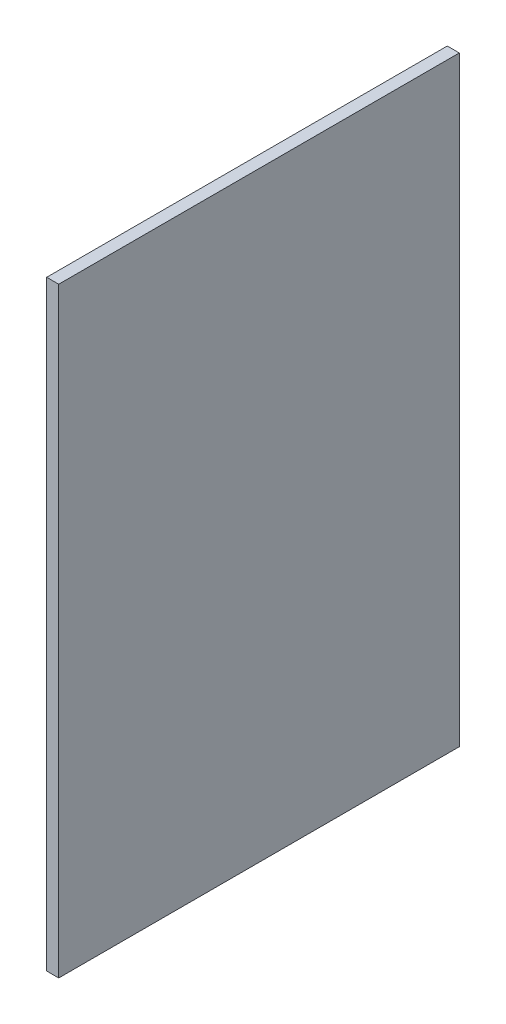
ISO-10303-21;
HEADER;
FILE_DESCRIPTION(('STEP AP214'),'2;1');
FILE_NAME('part.step','',(''),(''),'','','');
FILE_SCHEMA(('AUTOMOTIVE_DESIGN { 1 0 10303 214 1 1 1 1 }'));
ENDSEC;
DATA;
#1=APPLICATION_CONTEXT('core data for automotive mechanical design processes');
#2=APPLICATION_PROTOCOL_DEFINITION('international standard','automotive_design',2000,#1);
#3=PRODUCT_CONTEXT('',#1,'mechanical');
#4=PRODUCT('Part','Part','',(#3));
#5=PRODUCT_RELATED_PRODUCT_CATEGORY('part','',(#4));
#6=PRODUCT_DEFINITION_FORMATION('','',#4);
#7=PRODUCT_DEFINITION_CONTEXT('part definition',#1,'design');
#8=PRODUCT_DEFINITION('design','',#6,#7);
#9=PRODUCT_DEFINITION_SHAPE('','',#8);
#10=(LENGTH_UNIT() NAMED_UNIT(*) SI_UNIT(.MILLI.,.METRE.));
#11=(NAMED_UNIT(*) PLANE_ANGLE_UNIT() SI_UNIT($,.RADIAN.));
#12=(NAMED_UNIT(*) SI_UNIT($,.STERADIAN.) SOLID_ANGLE_UNIT());
#13=UNCERTAINTY_MEASURE_WITH_UNIT(LENGTH_MEASURE(1.E-05),#10,'distance_accuracy_value','');
#14=(GEOMETRIC_REPRESENTATION_CONTEXT(3) GLOBAL_UNCERTAINTY_ASSIGNED_CONTEXT((#13)) GLOBAL_UNIT_ASSIGNED_CONTEXT((#10,
#11,#12)) REPRESENTATION_CONTEXT('',''));
#15=CARTESIAN_POINT('',(0.,0.,0.));
#16=DIRECTION('',(0.,0.,1.));
#17=DIRECTION('',(1.,0.,0.));
#18=AXIS2_PLACEMENT_3D('',#15,#16,#17);
#19=CARTESIAN_POINT('',(18.,0.,0.));
#20=DIRECTION('',(0.,0.,-1.));
#21=DIRECTION('',(-1.,0.,0.));
#22=AXIS2_PLACEMENT_3D('',#19,#20,#21);
#23=PLANE('',#22);
#24=DIRECTION('',(0.,-1.,0.));
#25=VECTOR('',#24,1.);
#26=CARTESIAN_POINT('',(0.,0.,0.));
#27=LINE('',#26,#25);
#28=CARTESIAN_POINT('',(0.,900.,0.));
#29=VERTEX_POINT('',#28);
#30=CARTESIAN_POINT('',(0.,0.,0.));
#31=VERTEX_POINT('',#30);
#32=EDGE_CURVE('E107',#29,#31,#27,.T.);
#33=ORIENTED_EDGE('',*,*,#32,.T.);
#34=DIRECTION('',(-1.,0.,0.));
#35=VECTOR('',#34,1.);
#36=CARTESIAN_POINT('',(18.,0.,0.));
#37=LINE('',#36,#35);
#38=CARTESIAN_POINT('',(18.,0.,0.));
#39=VERTEX_POINT('',#38);
#40=EDGE_CURVE('E11',#39,#31,#37,.T.);
#41=ORIENTED_EDGE('',*,*,#40,.F.);
#42=DIRECTION('',(0.,-1.,0.));
#43=VECTOR('',#42,1.);
#44=CARTESIAN_POINT('',(18.,0.,0.));
#45=LINE('',#44,#43);
#46=CARTESIAN_POINT('',(18.,900.,0.));
#47=VERTEX_POINT('',#46);
#48=EDGE_CURVE('E91',#47,#39,#45,.T.);
#49=ORIENTED_EDGE('',*,*,#48,.F.);
#50=DIRECTION('',(-1.,0.,0.));
#51=VECTOR('',#50,1.);
#52=CARTESIAN_POINT('',(18.,900.,0.));
#53=LINE('',#52,#51);
#54=EDGE_CURVE('E103',#47,#29,#53,.T.);
#55=ORIENTED_EDGE('',*,*,#54,.T.);
#56=EDGE_LOOP('',(#33,#41,#49,#55));
#57=FACE_BOUND('',#56,.T.);
#58=ADVANCED_FACE('F39',(#57),#23,.F.);
#59=CARTESIAN_POINT('',(18.,0.,0.));
#60=DIRECTION('',(0.,1.,0.));
#61=DIRECTION('',(0.,0.,1.));
#62=AXIS2_PLACEMENT_3D('',#59,#60,#61);
#63=PLANE('',#62);
#64=DIRECTION('',(0.,0.,-1.));
#65=VECTOR('',#64,1.);
#66=CARTESIAN_POINT('',(0.,0.,0.));
#67=LINE('',#66,#65);
#68=CARTESIAN_POINT('',(0.,0.,-600.));
#69=VERTEX_POINT('',#68);
#70=EDGE_CURVE('E96',#31,#69,#67,.T.);
#71=ORIENTED_EDGE('',*,*,#70,.T.);
#72=DIRECTION('',(-1.,0.,0.));
#73=VECTOR('',#72,1.);
#74=CARTESIAN_POINT('',(18.,0.,-600.));
#75=LINE('',#74,#73);
#76=CARTESIAN_POINT('',(18.,0.,-600.));
#77=VERTEX_POINT('',#76);
#78=EDGE_CURVE('E48',#77,#69,#75,.T.);
#79=ORIENTED_EDGE('',*,*,#78,.F.);
#80=DIRECTION('',(0.,0.,-1.));
#81=VECTOR('',#80,1.);
#82=CARTESIAN_POINT('',(18.,0.,0.));
#83=LINE('',#82,#81);
#84=EDGE_CURVE('E86',#39,#77,#83,.T.);
#85=ORIENTED_EDGE('',*,*,#84,.F.);
#86=ORIENTED_EDGE('',*,*,#40,.T.);
#87=EDGE_LOOP('',(#71,#79,#85,#86));
#88=FACE_BOUND('',#87,.T.);
#89=ADVANCED_FACE('F95',(#88),#63,.F.);
#90=CARTESIAN_POINT('',(18.,0.,-600.));
#91=DIRECTION('',(0.,0.,1.));
#92=DIRECTION('',(1.,0.,0.));
#93=AXIS2_PLACEMENT_3D('',#90,#91,#92);
#94=PLANE('',#93);
#95=DIRECTION('',(0.,1.,0.));
#96=VECTOR('',#95,1.);
#97=CARTESIAN_POINT('',(0.,0.,-600.));
#98=LINE('',#97,#96);
#99=CARTESIAN_POINT('',(0.,900.,-600.));
#100=VERTEX_POINT('',#99);
#101=EDGE_CURVE('E73',#69,#100,#98,.T.);
#102=ORIENTED_EDGE('',*,*,#101,.T.);
#103=DIRECTION('',(-1.,0.,0.));
#104=VECTOR('',#103,1.);
#105=CARTESIAN_POINT('',(18.,900.,-600.));
#106=LINE('',#105,#104);
#107=CARTESIAN_POINT('',(18.,900.,-600.));
#108=VERTEX_POINT('',#107);
#109=EDGE_CURVE('E98',#108,#100,#106,.T.);
#110=ORIENTED_EDGE('',*,*,#109,.F.);
#111=DIRECTION('',(0.,1.,0.));
#112=VECTOR('',#111,1.);
#113=CARTESIAN_POINT('',(18.,0.,-600.));
#114=LINE('',#113,#112);
#115=EDGE_CURVE('E89',#77,#108,#114,.T.);
#116=ORIENTED_EDGE('',*,*,#115,.F.);
#117=ORIENTED_EDGE('',*,*,#78,.T.);
#118=EDGE_LOOP('',(#102,#110,#116,#117));
#119=FACE_BOUND('',#118,.T.);
#120=ADVANCED_FACE('F99',(#119),#94,.F.);
#121=CARTESIAN_POINT('',(18.,900.,0.));
#122=DIRECTION('',(0.,-1.,0.));
#123=DIRECTION('',(0.,0.,-1.));
#124=AXIS2_PLACEMENT_3D('',#121,#122,#123);
#125=PLANE('',#124);
#126=DIRECTION('',(0.,0.,1.));
#127=VECTOR('',#126,1.);
#128=CARTESIAN_POINT('',(0.,900.,0.));
#129=LINE('',#128,#127);
#130=EDGE_CURVE('E79',#100,#29,#129,.T.);
#131=ORIENTED_EDGE('',*,*,#130,.T.);
#132=ORIENTED_EDGE('',*,*,#54,.F.);
#133=DIRECTION('',(0.,0.,1.));
#134=VECTOR('',#133,1.);
#135=CARTESIAN_POINT('',(18.,900.,0.));
#136=LINE('',#135,#134);
#137=EDGE_CURVE('E56',#108,#47,#136,.T.);
#138=ORIENTED_EDGE('',*,*,#137,.F.);
#139=ORIENTED_EDGE('',*,*,#109,.T.);
#140=EDGE_LOOP('',(#131,#132,#138,#139));
#141=FACE_BOUND('',#140,.T.);
#142=ADVANCED_FACE('F120',(#141),#125,.F.);
#143=CARTESIAN_POINT('',(18.,0.,0.));
#144=DIRECTION('',(-1.,0.,0.));
#145=DIRECTION('',(0.,0.,1.));
#146=AXIS2_PLACEMENT_3D('',#143,#144,#145);
#147=PLANE('',#146);
#148=ORIENTED_EDGE('',*,*,#48,.T.);
#149=ORIENTED_EDGE('',*,*,#84,.T.);
#150=ORIENTED_EDGE('',*,*,#115,.T.);
#151=ORIENTED_EDGE('',*,*,#137,.T.);
#152=EDGE_LOOP('',(#148,#149,#150,#151));
#153=FACE_BOUND('',#152,.T.);
#154=ADVANCED_FACE('F87',(#153),#147,.F.);
#155=CARTESIAN_POINT('',(0.,0.,0.));
#156=DIRECTION('',(-1.,0.,0.));
#157=DIRECTION('',(0.,0.,1.));
#158=AXIS2_PLACEMENT_3D('',#155,#156,#157);
#159=PLANE('',#158);
#160=ORIENTED_EDGE('',*,*,#32,.F.);
#161=ORIENTED_EDGE('',*,*,#130,.F.);
#162=ORIENTED_EDGE('',*,*,#101,.F.);
#163=ORIENTED_EDGE('',*,*,#70,.F.);
#164=EDGE_LOOP('',(#160,#161,#162,#163));
#165=FACE_BOUND('',#164,.T.);
#166=ADVANCED_FACE('F123',(#165),#159,.T.);
#167=CLOSED_SHELL('',(#58,#89,#120,#142,#154,#166));
#168=MANIFOLD_SOLID_BREP('B2',#167);
#169=ADVANCED_BREP_SHAPE_REPRESENTATION('',(#18,#168),#14);
#170=SHAPE_DEFINITION_REPRESENTATION(#9,#169);
ENDSEC;
END-ISO-10303-21;
